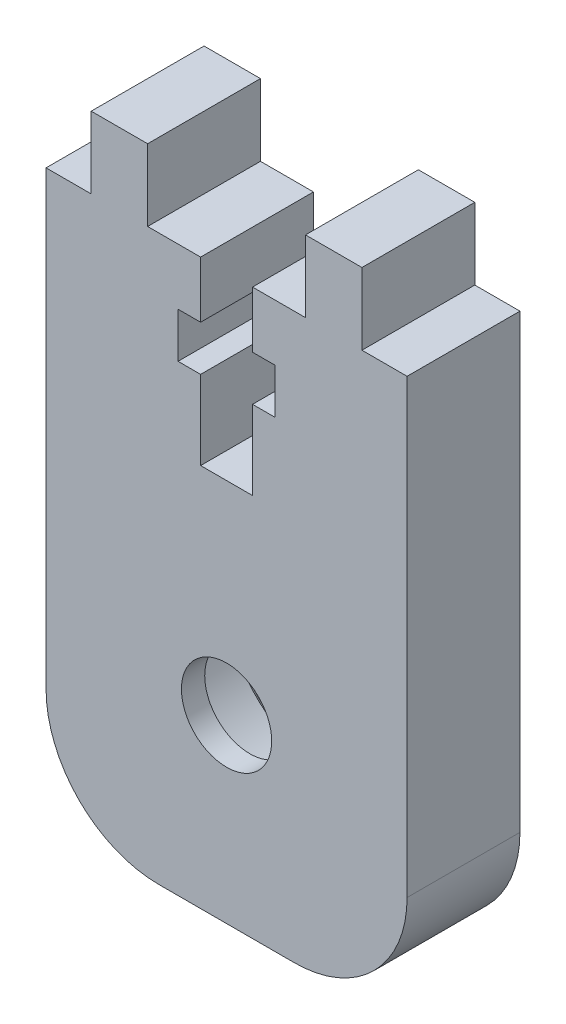
ISO-10303-21;
HEADER;
FILE_DESCRIPTION(('STEP AP214'),'2;1');
FILE_NAME('part.step','',(''),(''),'','','');
FILE_SCHEMA(('AUTOMOTIVE_DESIGN { 1 0 10303 214 1 1 1 1 }'));
ENDSEC;
DATA;
#1=APPLICATION_CONTEXT('core data for automotive mechanical design processes');
#2=APPLICATION_PROTOCOL_DEFINITION('international standard','automotive_design',2000,#1);
#3=PRODUCT_CONTEXT('',#1,'mechanical');
#4=PRODUCT('Part','Part','',(#3));
#5=PRODUCT_RELATED_PRODUCT_CATEGORY('part','',(#4));
#6=PRODUCT_DEFINITION_FORMATION('','',#4);
#7=PRODUCT_DEFINITION_CONTEXT('part definition',#1,'design');
#8=PRODUCT_DEFINITION('design','',#6,#7);
#9=PRODUCT_DEFINITION_SHAPE('','',#8);
#10=(LENGTH_UNIT() NAMED_UNIT(*) SI_UNIT(.MILLI.,.METRE.));
#11=(NAMED_UNIT(*) PLANE_ANGLE_UNIT() SI_UNIT($,.RADIAN.));
#12=(NAMED_UNIT(*) SI_UNIT($,.STERADIAN.) SOLID_ANGLE_UNIT());
#13=UNCERTAINTY_MEASURE_WITH_UNIT(LENGTH_MEASURE(1.E-05),#10,'distance_accuracy_value','');
#14=(GEOMETRIC_REPRESENTATION_CONTEXT(3) GLOBAL_UNCERTAINTY_ASSIGNED_CONTEXT((#13)) GLOBAL_UNIT_ASSIGNED_CONTEXT((#10,
#11,#12)) REPRESENTATION_CONTEXT('',''));
#15=CARTESIAN_POINT('',(0.,0.,0.));
#16=DIRECTION('',(0.,0.,1.));
#17=DIRECTION('',(1.,0.,0.));
#18=AXIS2_PLACEMENT_3D('',#15,#16,#17);
#19=CARTESIAN_POINT('',(0.,-4.5,3.96875));
#20=DIRECTION('',(0.,0.,-1.));
#21=DIRECTION('',(-1.,0.,0.));
#22=AXIS2_PLACEMENT_3D('',#19,#20,#21);
#23=PLANE('',#22);
#24=CARTESIAN_POINT('',(0.,-4.5,3.96875));
#25=DIRECTION('',(0.,0.,-1.));
#26=DIRECTION('',(-1.,0.,0.));
#27=AXIS2_PLACEMENT_3D('',#24,#25,#26);
#28=CIRCLE('',#27,2.);
#29=CARTESIAN_POINT('',(-2.00000000000001,-4.5,3.96875));
#30=VERTEX_POINT('',#29);
#31=EDGE_CURVE('E689',#30,#30,#28,.T.);
#32=ORIENTED_EDGE('',*,*,#31,.F.);
#33=EDGE_LOOP('',(#32));
#34=FACE_BOUND('',#33,.T.);
#35=CARTESIAN_POINT('',(0.,-4.5,3.96875));
#36=DIRECTION('',(0.,0.,1.));
#37=DIRECTION('',(1.,0.,0.));
#38=AXIS2_PLACEMENT_3D('',#35,#36,#37);
#39=CIRCLE('',#38,4.68819660112501);
#40=CARTESIAN_POINT('',(4.688196601125,-4.5,3.96875));
#41=VERTEX_POINT('',#40);
#42=EDGE_CURVE('E42',#41,#41,#39,.T.);
#43=ORIENTED_EDGE('',*,*,#42,.F.);
#44=EDGE_LOOP('',(#43));
#45=FACE_BOUND('',#44,.T.);
#46=ADVANCED_FACE('F38',(#34,#45),#23,.T.);
#47=CARTESIAN_POINT('',(-5.998,12.5,5.));
#48=DIRECTION('',(0.,-1.,0.));
#49=DIRECTION('',(0.,0.,-1.));
#50=AXIS2_PLACEMENT_3D('',#47,#48,#49);
#51=PLANE('',#50);
#52=DIRECTION('',(-1.,0.,0.));
#53=VECTOR('',#52,1.);
#54=CARTESIAN_POINT('',(-5.998,12.5,0.));
#55=LINE('',#54,#53);
#56=CARTESIAN_POINT('',(-5.998,12.5,0.));
#57=VERTEX_POINT('',#56);
#58=CARTESIAN_POINT('',(-7.998,12.5,0.));
#59=VERTEX_POINT('',#58);
#60=EDGE_CURVE('E236',#57,#59,#55,.T.);
#61=ORIENTED_EDGE('',*,*,#60,.T.);
#62=DIRECTION('',(0.,0.,-1.));
#63=VECTOR('',#62,1.);
#64=CARTESIAN_POINT('',(-7.998,12.5,5.));
#65=LINE('',#64,#63);
#66=CARTESIAN_POINT('',(-7.998,12.5,5.));
#67=VERTEX_POINT('',#66);
#68=EDGE_CURVE('E217',#67,#59,#65,.T.);
#69=ORIENTED_EDGE('',*,*,#68,.F.);
#70=DIRECTION('',(-1.,0.,0.));
#71=VECTOR('',#70,1.);
#72=CARTESIAN_POINT('',(-5.998,12.5,5.));
#73=LINE('',#72,#71);
#74=CARTESIAN_POINT('',(-5.998,12.5,5.));
#75=VERTEX_POINT('',#74);
#76=EDGE_CURVE('E222',#75,#67,#73,.T.);
#77=ORIENTED_EDGE('',*,*,#76,.F.);
#78=DIRECTION('',(0.,0.,-1.));
#79=VECTOR('',#78,1.);
#80=CARTESIAN_POINT('',(-5.998,12.5,5.));
#81=LINE('',#80,#79);
#82=EDGE_CURVE('E477',#75,#57,#81,.T.);
#83=ORIENTED_EDGE('',*,*,#82,.T.);
#84=EDGE_LOOP('',(#61,#69,#77,#83));
#85=FACE_BOUND('',#84,.T.);
#86=ADVANCED_FACE('F234',(#85),#51,.F.);
#87=CARTESIAN_POINT('',(-7.998,-12.5,5.));
#88=DIRECTION('',(1.,0.,0.));
#89=DIRECTION('',(0.,0.,-1.));
#90=AXIS2_PLACEMENT_3D('',#87,#88,#89);
#91=PLANE('',#90);
#92=DIRECTION('',(0.,-1.,0.));
#93=VECTOR('',#92,1.);
#94=CARTESIAN_POINT('',(-7.998,-12.5,0.));
#95=LINE('',#94,#93);
#96=CARTESIAN_POINT('',(-7.998,-7.5,0.));
#97=VERTEX_POINT('',#96);
#98=EDGE_CURVE('E480',#59,#97,#95,.T.);
#99=ORIENTED_EDGE('',*,*,#98,.T.);
#100=DIRECTION('',(0.,0.,-1.));
#101=VECTOR('',#100,1.);
#102=CARTESIAN_POINT('',(-7.998,-7.5,5.));
#103=LINE('',#102,#101);
#104=CARTESIAN_POINT('',(-7.998,-7.5,5.));
#105=VERTEX_POINT('',#104);
#106=EDGE_CURVE('E63',#97,#105,#103,.F.);
#107=ORIENTED_EDGE('',*,*,#106,.T.);
#108=DIRECTION('',(0.,-1.,0.));
#109=VECTOR('',#108,1.);
#110=CARTESIAN_POINT('',(-7.998,-12.5,5.));
#111=LINE('',#110,#109);
#112=EDGE_CURVE('E213',#67,#105,#111,.T.);
#113=ORIENTED_EDGE('',*,*,#112,.F.);
#114=ORIENTED_EDGE('',*,*,#68,.T.);
#115=EDGE_LOOP('',(#99,#107,#113,#114));
#116=FACE_BOUND('',#115,.T.);
#117=ADVANCED_FACE('F215',(#116),#91,.F.);
#118=CARTESIAN_POINT('',(7.998,-12.5,5.));
#119=DIRECTION('',(0.,1.,0.));
#120=DIRECTION('',(-1.,0.,0.));
#121=AXIS2_PLACEMENT_3D('',#118,#119,#120);
#122=PLANE('',#121);
#123=DIRECTION('',(1.,0.,0.));
#124=VECTOR('',#123,1.);
#125=CARTESIAN_POINT('',(7.998,-12.5,5.));
#126=LINE('',#125,#124);
#127=CARTESIAN_POINT('',(-2.998,-12.5,5.));
#128=VERTEX_POINT('',#127);
#129=CARTESIAN_POINT('',(2.998,-12.5,5.));
#130=VERTEX_POINT('',#129);
#131=EDGE_CURVE('E221',#128,#130,#126,.T.);
#132=ORIENTED_EDGE('',*,*,#131,.F.);
#133=DIRECTION('',(0.,0.,-1.));
#134=VECTOR('',#133,1.);
#135=CARTESIAN_POINT('',(-2.998,-12.5,5.));
#136=LINE('',#135,#134);
#137=CARTESIAN_POINT('',(-2.998,-12.5,0.));
#138=VERTEX_POINT('',#137);
#139=EDGE_CURVE('E243',#128,#138,#136,.T.);
#140=ORIENTED_EDGE('',*,*,#139,.T.);
#141=DIRECTION('',(1.,0.,0.));
#142=VECTOR('',#141,1.);
#143=CARTESIAN_POINT('',(7.998,-12.5,0.));
#144=LINE('',#143,#142);
#145=CARTESIAN_POINT('',(2.998,-12.5,0.));
#146=VERTEX_POINT('',#145);
#147=EDGE_CURVE('E484',#138,#146,#144,.T.);
#148=ORIENTED_EDGE('',*,*,#147,.T.);
#149=DIRECTION('',(0.,0.,-1.));
#150=VECTOR('',#149,1.);
#151=CARTESIAN_POINT('',(2.998,-12.5,5.));
#152=LINE('',#151,#150);
#153=EDGE_CURVE('E238',#146,#130,#152,.F.);
#154=ORIENTED_EDGE('',*,*,#153,.T.);
#155=EDGE_LOOP('',(#132,#140,#148,#154));
#156=FACE_BOUND('',#155,.T.);
#157=ADVANCED_FACE('F394',(#156),#122,.F.);
#158=CARTESIAN_POINT('',(7.998,-12.5,5.));
#159=DIRECTION('',(-1.,0.,0.));
#160=DIRECTION('',(0.,0.,1.));
#161=AXIS2_PLACEMENT_3D('',#158,#159,#160);
#162=PLANE('',#161);
#163=DIRECTION('',(0.,1.,0.));
#164=VECTOR('',#163,1.);
#165=CARTESIAN_POINT('',(7.998,-12.5,5.));
#166=LINE('',#165,#164);
#167=CARTESIAN_POINT('',(7.998,-7.5,5.));
#168=VERTEX_POINT('',#167);
#169=CARTESIAN_POINT('',(7.998,12.5,5.));
#170=VERTEX_POINT('',#169);
#171=EDGE_CURVE('E413',#168,#170,#166,.T.);
#172=ORIENTED_EDGE('',*,*,#171,.F.);
#173=DIRECTION('',(0.,0.,-1.));
#174=VECTOR('',#173,1.);
#175=CARTESIAN_POINT('',(7.998,-7.5,5.));
#176=LINE('',#175,#174);
#177=CARTESIAN_POINT('',(7.998,-7.5,0.));
#178=VERTEX_POINT('',#177);
#179=EDGE_CURVE('E266',#168,#178,#176,.T.);
#180=ORIENTED_EDGE('',*,*,#179,.T.);
#181=DIRECTION('',(0.,1.,0.));
#182=VECTOR('',#181,1.);
#183=CARTESIAN_POINT('',(7.998,-12.5,0.));
#184=LINE('',#183,#182);
#185=CARTESIAN_POINT('',(7.998,12.5,0.));
#186=VERTEX_POINT('',#185);
#187=EDGE_CURVE('E487',#178,#186,#184,.T.);
#188=ORIENTED_EDGE('',*,*,#187,.T.);
#189=DIRECTION('',(0.,0.,-1.));
#190=VECTOR('',#189,1.);
#191=CARTESIAN_POINT('',(7.998,12.5,5.));
#192=LINE('',#191,#190);
#193=EDGE_CURVE('E239',#170,#186,#192,.T.);
#194=ORIENTED_EDGE('',*,*,#193,.F.);
#195=EDGE_LOOP('',(#172,#180,#188,#194));
#196=FACE_BOUND('',#195,.T.);
#197=ADVANCED_FACE('F390',(#196),#162,.F.);
#198=CARTESIAN_POINT('',(7.998,12.5,5.));
#199=DIRECTION('',(0.,-1.,0.));
#200=DIRECTION('',(0.,0.,-1.));
#201=AXIS2_PLACEMENT_3D('',#198,#199,#200);
#202=PLANE('',#201);
#203=DIRECTION('',(-1.,0.,0.));
#204=VECTOR('',#203,1.);
#205=CARTESIAN_POINT('',(7.998,12.5,0.));
#206=LINE('',#205,#204);
#207=CARTESIAN_POINT('',(5.998,12.5,0.));
#208=VERTEX_POINT('',#207);
#209=EDGE_CURVE('E490',#186,#208,#206,.T.);
#210=ORIENTED_EDGE('',*,*,#209,.T.);
#211=DIRECTION('',(0.,0.,-1.));
#212=VECTOR('',#211,1.);
#213=CARTESIAN_POINT('',(5.998,12.5,5.));
#214=LINE('',#213,#212);
#215=CARTESIAN_POINT('',(5.998,12.5,5.));
#216=VERTEX_POINT('',#215);
#217=EDGE_CURVE('E246',#216,#208,#214,.T.);
#218=ORIENTED_EDGE('',*,*,#217,.F.);
#219=DIRECTION('',(-1.,0.,0.));
#220=VECTOR('',#219,1.);
#221=CARTESIAN_POINT('',(7.998,12.5,5.));
#222=LINE('',#221,#220);
#223=EDGE_CURVE('E416',#170,#216,#222,.T.);
#224=ORIENTED_EDGE('',*,*,#223,.F.);
#225=ORIENTED_EDGE('',*,*,#193,.T.);
#226=EDGE_LOOP('',(#210,#218,#224,#225));
#227=FACE_BOUND('',#226,.T.);
#228=ADVANCED_FACE('F386',(#227),#202,.F.);
#229=CARTESIAN_POINT('',(5.998,12.5,5.));
#230=DIRECTION('',(-1.,0.,0.));
#231=DIRECTION('',(0.,0.,1.));
#232=AXIS2_PLACEMENT_3D('',#229,#230,#231);
#233=PLANE('',#232);
#234=DIRECTION('',(0.,1.,0.));
#235=VECTOR('',#234,1.);
#236=CARTESIAN_POINT('',(5.998,12.5,0.));
#237=LINE('',#236,#235);
#238=CARTESIAN_POINT('',(5.998,15.675,0.));
#239=VERTEX_POINT('',#238);
#240=EDGE_CURVE('E493',#208,#239,#237,.T.);
#241=ORIENTED_EDGE('',*,*,#240,.T.);
#242=DIRECTION('',(0.,0.,-1.));
#243=VECTOR('',#242,1.);
#244=CARTESIAN_POINT('',(5.998,15.675,5.));
#245=LINE('',#244,#243);
#246=CARTESIAN_POINT('',(5.998,15.675,5.));
#247=VERTEX_POINT('',#246);
#248=EDGE_CURVE('E619',#247,#239,#245,.T.);
#249=ORIENTED_EDGE('',*,*,#248,.F.);
#250=DIRECTION('',(0.,1.,0.));
#251=VECTOR('',#250,1.);
#252=CARTESIAN_POINT('',(5.998,12.5,5.));
#253=LINE('',#252,#251);
#254=EDGE_CURVE('E421',#216,#247,#253,.T.);
#255=ORIENTED_EDGE('',*,*,#254,.F.);
#256=ORIENTED_EDGE('',*,*,#217,.T.);
#257=EDGE_LOOP('',(#241,#249,#255,#256));
#258=FACE_BOUND('',#257,.T.);
#259=ADVANCED_FACE('F382',(#258),#233,.F.);
#260=CARTESIAN_POINT('',(5.998,15.675,5.));
#261=DIRECTION('',(0.,-1.,0.));
#262=DIRECTION('',(0.,0.,-1.));
#263=AXIS2_PLACEMENT_3D('',#260,#261,#262);
#264=PLANE('',#263);
#265=DIRECTION('',(-1.,0.,0.));
#266=VECTOR('',#265,1.);
#267=CARTESIAN_POINT('',(5.998,15.675,0.));
#268=LINE('',#267,#266);
#269=CARTESIAN_POINT('',(3.498,15.675,0.));
#270=VERTEX_POINT('',#269);
#271=EDGE_CURVE('E496',#239,#270,#268,.T.);
#272=ORIENTED_EDGE('',*,*,#271,.T.);
#273=DIRECTION('',(0.,0.,-1.));
#274=VECTOR('',#273,1.);
#275=CARTESIAN_POINT('',(3.498,15.675,5.));
#276=LINE('',#275,#274);
#277=CARTESIAN_POINT('',(3.498,15.675,5.));
#278=VERTEX_POINT('',#277);
#279=EDGE_CURVE('E615',#278,#270,#276,.T.);
#280=ORIENTED_EDGE('',*,*,#279,.F.);
#281=DIRECTION('',(-1.,0.,0.));
#282=VECTOR('',#281,1.);
#283=CARTESIAN_POINT('',(5.998,15.675,5.));
#284=LINE('',#283,#282);
#285=EDGE_CURVE('E424',#247,#278,#284,.T.);
#286=ORIENTED_EDGE('',*,*,#285,.F.);
#287=ORIENTED_EDGE('',*,*,#248,.T.);
#288=EDGE_LOOP('',(#272,#280,#286,#287));
#289=FACE_BOUND('',#288,.T.);
#290=ADVANCED_FACE('F378',(#289),#264,.F.);
#291=CARTESIAN_POINT('',(3.498,12.5,5.));
#292=DIRECTION('',(1.,0.,0.));
#293=DIRECTION('',(0.,0.,-1.));
#294=AXIS2_PLACEMENT_3D('',#291,#292,#293);
#295=PLANE('',#294);
#296=DIRECTION('',(0.,-1.,0.));
#297=VECTOR('',#296,1.);
#298=CARTESIAN_POINT('',(3.498,12.5,0.));
#299=LINE('',#298,#297);
#300=CARTESIAN_POINT('',(3.498,12.5,0.));
#301=VERTEX_POINT('',#300);
#302=EDGE_CURVE('E499',#270,#301,#299,.T.);
#303=ORIENTED_EDGE('',*,*,#302,.T.);
#304=DIRECTION('',(0.,0.,-1.));
#305=VECTOR('',#304,1.);
#306=CARTESIAN_POINT('',(3.498,12.5,5.));
#307=LINE('',#306,#305);
#308=CARTESIAN_POINT('',(3.498,12.5,5.));
#309=VERTEX_POINT('',#308);
#310=EDGE_CURVE('E611',#309,#301,#307,.T.);
#311=ORIENTED_EDGE('',*,*,#310,.F.);
#312=DIRECTION('',(0.,-1.,0.));
#313=VECTOR('',#312,1.);
#314=CARTESIAN_POINT('',(3.498,12.5,5.));
#315=LINE('',#314,#313);
#316=EDGE_CURVE('E427',#278,#309,#315,.T.);
#317=ORIENTED_EDGE('',*,*,#316,.F.);
#318=ORIENTED_EDGE('',*,*,#279,.T.);
#319=EDGE_LOOP('',(#303,#311,#317,#318));
#320=FACE_BOUND('',#319,.T.);
#321=ADVANCED_FACE('F374',(#320),#295,.F.);
#322=CARTESIAN_POINT('',(1.15,12.5,5.));
#323=DIRECTION('',(0.,-1.,0.));
#324=DIRECTION('',(1.,0.,0.));
#325=AXIS2_PLACEMENT_3D('',#322,#323,#324);
#326=PLANE('',#325);
#327=DIRECTION('',(-1.,0.,0.));
#328=VECTOR('',#327,1.);
#329=CARTESIAN_POINT('',(1.15,12.5,0.));
#330=LINE('',#329,#328);
#331=CARTESIAN_POINT('',(1.15,12.5,0.));
#332=VERTEX_POINT('',#331);
#333=EDGE_CURVE('E502',#301,#332,#330,.T.);
#334=ORIENTED_EDGE('',*,*,#333,.T.);
#335=DIRECTION('',(0.,0.,-1.));
#336=VECTOR('',#335,1.);
#337=CARTESIAN_POINT('',(1.15,12.5,5.));
#338=LINE('',#337,#336);
#339=CARTESIAN_POINT('',(1.15,12.5,5.));
#340=VERTEX_POINT('',#339);
#341=EDGE_CURVE('E607',#340,#332,#338,.T.);
#342=ORIENTED_EDGE('',*,*,#341,.F.);
#343=DIRECTION('',(-1.,0.,0.));
#344=VECTOR('',#343,1.);
#345=CARTESIAN_POINT('',(1.15,12.5,5.));
#346=LINE('',#345,#344);
#347=EDGE_CURVE('E430',#309,#340,#346,.T.);
#348=ORIENTED_EDGE('',*,*,#347,.F.);
#349=ORIENTED_EDGE('',*,*,#310,.T.);
#350=EDGE_LOOP('',(#334,#342,#348,#349));
#351=FACE_BOUND('',#350,.T.);
#352=ADVANCED_FACE('F370',(#351),#326,.F.);
#353=CARTESIAN_POINT('',(1.15,12.5,5.));
#354=DIRECTION('',(1.,0.,0.));
#355=DIRECTION('',(0.,1.,0.));
#356=AXIS2_PLACEMENT_3D('',#353,#354,#355);
#357=PLANE('',#356);
#358=DIRECTION('',(0.,-1.,0.));
#359=VECTOR('',#358,1.);
#360=CARTESIAN_POINT('',(1.15,12.5,0.));
#361=LINE('',#360,#359);
#362=CARTESIAN_POINT('',(1.15,10.,0.));
#363=VERTEX_POINT('',#362);
#364=EDGE_CURVE('E505',#332,#363,#361,.T.);
#365=ORIENTED_EDGE('',*,*,#364,.T.);
#366=DIRECTION('',(0.,0.,-1.));
#367=VECTOR('',#366,1.);
#368=CARTESIAN_POINT('',(1.15,10.,5.));
#369=LINE('',#368,#367);
#370=CARTESIAN_POINT('',(1.15,10.,5.));
#371=VERTEX_POINT('',#370);
#372=EDGE_CURVE('E603',#371,#363,#369,.T.);
#373=ORIENTED_EDGE('',*,*,#372,.F.);
#374=DIRECTION('',(0.,-1.,0.));
#375=VECTOR('',#374,1.);
#376=CARTESIAN_POINT('',(1.15,12.5,5.));
#377=LINE('',#376,#375);
#378=EDGE_CURVE('E433',#340,#371,#377,.T.);
#379=ORIENTED_EDGE('',*,*,#378,.F.);
#380=ORIENTED_EDGE('',*,*,#341,.T.);
#381=EDGE_LOOP('',(#365,#373,#379,#380));
#382=FACE_BOUND('',#381,.T.);
#383=ADVANCED_FACE('F366',(#382),#357,.F.);
#384=CARTESIAN_POINT('',(2.15,10.,5.));
#385=DIRECTION('',(0.,1.,0.));
#386=DIRECTION('',(0.,0.,1.));
#387=AXIS2_PLACEMENT_3D('',#384,#385,#386);
#388=PLANE('',#387);
#389=DIRECTION('',(1.,0.,0.));
#390=VECTOR('',#389,1.);
#391=CARTESIAN_POINT('',(2.15,10.,0.));
#392=LINE('',#391,#390);
#393=CARTESIAN_POINT('',(2.15,10.,0.));
#394=VERTEX_POINT('',#393);
#395=EDGE_CURVE('E508',#363,#394,#392,.T.);
#396=ORIENTED_EDGE('',*,*,#395,.T.);
#397=DIRECTION('',(0.,0.,-1.));
#398=VECTOR('',#397,1.);
#399=CARTESIAN_POINT('',(2.15,10.,5.));
#400=LINE('',#399,#398);
#401=CARTESIAN_POINT('',(2.15,10.,5.));
#402=VERTEX_POINT('',#401);
#403=EDGE_CURVE('E599',#402,#394,#400,.T.);
#404=ORIENTED_EDGE('',*,*,#403,.F.);
#405=DIRECTION('',(1.,0.,0.));
#406=VECTOR('',#405,1.);
#407=CARTESIAN_POINT('',(2.15,10.,5.));
#408=LINE('',#407,#406);
#409=EDGE_CURVE('E436',#371,#402,#408,.T.);
#410=ORIENTED_EDGE('',*,*,#409,.F.);
#411=ORIENTED_EDGE('',*,*,#372,.T.);
#412=EDGE_LOOP('',(#396,#404,#410,#411));
#413=FACE_BOUND('',#412,.T.);
#414=ADVANCED_FACE('F362',(#413),#388,.F.);
#415=CARTESIAN_POINT('',(2.15,10.,5.));
#416=DIRECTION('',(1.,0.,0.));
#417=DIRECTION('',(0.,1.,0.));
#418=AXIS2_PLACEMENT_3D('',#415,#416,#417);
#419=PLANE('',#418);
#420=DIRECTION('',(0.,-1.,0.));
#421=VECTOR('',#420,1.);
#422=CARTESIAN_POINT('',(2.15,10.,0.));
#423=LINE('',#422,#421);
#424=CARTESIAN_POINT('',(2.15,8.,0.));
#425=VERTEX_POINT('',#424);
#426=EDGE_CURVE('E511',#394,#425,#423,.T.);
#427=ORIENTED_EDGE('',*,*,#426,.T.);
#428=DIRECTION('',(0.,0.,-1.));
#429=VECTOR('',#428,1.);
#430=CARTESIAN_POINT('',(2.15,8.,5.));
#431=LINE('',#430,#429);
#432=CARTESIAN_POINT('',(2.15,8.,5.));
#433=VERTEX_POINT('',#432);
#434=EDGE_CURVE('E595',#433,#425,#431,.T.);
#435=ORIENTED_EDGE('',*,*,#434,.F.);
#436=DIRECTION('',(0.,-1.,0.));
#437=VECTOR('',#436,1.);
#438=CARTESIAN_POINT('',(2.15,10.,5.));
#439=LINE('',#438,#437);
#440=EDGE_CURVE('E439',#402,#433,#439,.T.);
#441=ORIENTED_EDGE('',*,*,#440,.F.);
#442=ORIENTED_EDGE('',*,*,#403,.T.);
#443=EDGE_LOOP('',(#427,#435,#441,#442));
#444=FACE_BOUND('',#443,.T.);
#445=ADVANCED_FACE('F358',(#444),#419,.F.);
#446=CARTESIAN_POINT('',(2.15,8.,5.));
#447=DIRECTION('',(0.,-1.,0.));
#448=DIRECTION('',(0.,0.,-1.));
#449=AXIS2_PLACEMENT_3D('',#446,#447,#448);
#450=PLANE('',#449);
#451=DIRECTION('',(-1.,0.,0.));
#452=VECTOR('',#451,1.);
#453=CARTESIAN_POINT('',(2.15,8.,0.));
#454=LINE('',#453,#452);
#455=CARTESIAN_POINT('',(1.15,8.,0.));
#456=VERTEX_POINT('',#455);
#457=EDGE_CURVE('E514',#425,#456,#454,.T.);
#458=ORIENTED_EDGE('',*,*,#457,.T.);
#459=DIRECTION('',(0.,0.,-1.));
#460=VECTOR('',#459,1.);
#461=CARTESIAN_POINT('',(1.15,8.,5.));
#462=LINE('',#461,#460);
#463=CARTESIAN_POINT('',(1.15,8.,5.));
#464=VERTEX_POINT('',#463);
#465=EDGE_CURVE('E591',#464,#456,#462,.T.);
#466=ORIENTED_EDGE('',*,*,#465,.F.);
#467=DIRECTION('',(-1.,0.,0.));
#468=VECTOR('',#467,1.);
#469=CARTESIAN_POINT('',(2.15,8.,5.));
#470=LINE('',#469,#468);
#471=EDGE_CURVE('E442',#433,#464,#470,.T.);
#472=ORIENTED_EDGE('',*,*,#471,.F.);
#473=ORIENTED_EDGE('',*,*,#434,.T.);
#474=EDGE_LOOP('',(#458,#466,#472,#473));
#475=FACE_BOUND('',#474,.T.);
#476=ADVANCED_FACE('F354',(#475),#450,.F.);
#477=CARTESIAN_POINT('',(1.15,8.,5.));
#478=DIRECTION('',(1.,0.,0.));
#479=DIRECTION('',(0.,0.,-1.));
#480=AXIS2_PLACEMENT_3D('',#477,#478,#479);
#481=PLANE('',#480);
#482=DIRECTION('',(0.,-1.,0.));
#483=VECTOR('',#482,1.);
#484=CARTESIAN_POINT('',(1.15,8.,0.));
#485=LINE('',#484,#483);
#486=CARTESIAN_POINT('',(1.15,4.5,0.));
#487=VERTEX_POINT('',#486);
#488=EDGE_CURVE('E517',#456,#487,#485,.T.);
#489=ORIENTED_EDGE('',*,*,#488,.T.);
#490=DIRECTION('',(0.,0.,-1.));
#491=VECTOR('',#490,1.);
#492=CARTESIAN_POINT('',(1.15,4.5,5.));
#493=LINE('',#492,#491);
#494=CARTESIAN_POINT('',(1.15,4.5,5.));
#495=VERTEX_POINT('',#494);
#496=EDGE_CURVE('E587',#495,#487,#493,.T.);
#497=ORIENTED_EDGE('',*,*,#496,.F.);
#498=DIRECTION('',(0.,-1.,0.));
#499=VECTOR('',#498,1.);
#500=CARTESIAN_POINT('',(1.15,8.,5.));
#501=LINE('',#500,#499);
#502=EDGE_CURVE('E445',#464,#495,#501,.T.);
#503=ORIENTED_EDGE('',*,*,#502,.F.);
#504=ORIENTED_EDGE('',*,*,#465,.T.);
#505=EDGE_LOOP('',(#489,#497,#503,#504));
#506=FACE_BOUND('',#505,.T.);
#507=ADVANCED_FACE('F350',(#506),#481,.F.);
#508=CARTESIAN_POINT('',(1.15,4.5,5.));
#509=DIRECTION('',(0.,-1.,0.));
#510=DIRECTION('',(0.,0.,-1.));
#511=AXIS2_PLACEMENT_3D('',#508,#509,#510);
#512=PLANE('',#511);
#513=DIRECTION('',(-1.,0.,0.));
#514=VECTOR('',#513,1.);
#515=CARTESIAN_POINT('',(1.15,4.5,0.));
#516=LINE('',#515,#514);
#517=CARTESIAN_POINT('',(-1.15,4.5,0.));
#518=VERTEX_POINT('',#517);
#519=EDGE_CURVE('E520',#487,#518,#516,.T.);
#520=ORIENTED_EDGE('',*,*,#519,.T.);
#521=DIRECTION('',(0.,0.,-1.));
#522=VECTOR('',#521,1.);
#523=CARTESIAN_POINT('',(-1.15,4.5,5.));
#524=LINE('',#523,#522);
#525=CARTESIAN_POINT('',(-1.15,4.5,5.));
#526=VERTEX_POINT('',#525);
#527=EDGE_CURVE('E583',#526,#518,#524,.T.);
#528=ORIENTED_EDGE('',*,*,#527,.F.);
#529=DIRECTION('',(-1.,0.,0.));
#530=VECTOR('',#529,1.);
#531=CARTESIAN_POINT('',(1.15,4.5,5.));
#532=LINE('',#531,#530);
#533=EDGE_CURVE('E448',#495,#526,#532,.T.);
#534=ORIENTED_EDGE('',*,*,#533,.F.);
#535=ORIENTED_EDGE('',*,*,#496,.T.);
#536=EDGE_LOOP('',(#520,#528,#534,#535));
#537=FACE_BOUND('',#536,.T.);
#538=ADVANCED_FACE('F346',(#537),#512,.F.);
#539=CARTESIAN_POINT('',(-1.15,8.,5.));
#540=DIRECTION('',(-1.,0.,0.));
#541=DIRECTION('',(0.,0.,1.));
#542=AXIS2_PLACEMENT_3D('',#539,#540,#541);
#543=PLANE('',#542);
#544=DIRECTION('',(0.,1.,0.));
#545=VECTOR('',#544,1.);
#546=CARTESIAN_POINT('',(-1.15,8.,0.));
#547=LINE('',#546,#545);
#548=CARTESIAN_POINT('',(-1.15,8.,0.));
#549=VERTEX_POINT('',#548);
#550=EDGE_CURVE('E523',#518,#549,#547,.T.);
#551=ORIENTED_EDGE('',*,*,#550,.T.);
#552=DIRECTION('',(0.,0.,-1.));
#553=VECTOR('',#552,1.);
#554=CARTESIAN_POINT('',(-1.15,8.,5.));
#555=LINE('',#554,#553);
#556=CARTESIAN_POINT('',(-1.15,8.,5.));
#557=VERTEX_POINT('',#556);
#558=EDGE_CURVE('E579',#557,#549,#555,.T.);
#559=ORIENTED_EDGE('',*,*,#558,.F.);
#560=DIRECTION('',(0.,1.,0.));
#561=VECTOR('',#560,1.);
#562=CARTESIAN_POINT('',(-1.15,8.,5.));
#563=LINE('',#562,#561);
#564=EDGE_CURVE('E451',#526,#557,#563,.T.);
#565=ORIENTED_EDGE('',*,*,#564,.F.);
#566=ORIENTED_EDGE('',*,*,#527,.T.);
#567=EDGE_LOOP('',(#551,#559,#565,#566));
#568=FACE_BOUND('',#567,.T.);
#569=ADVANCED_FACE('F342',(#568),#543,.F.);
#570=CARTESIAN_POINT('',(-1.15,8.,5.));
#571=DIRECTION('',(0.,-1.,0.));
#572=DIRECTION('',(0.,0.,-1.));
#573=AXIS2_PLACEMENT_3D('',#570,#571,#572);
#574=PLANE('',#573);
#575=DIRECTION('',(-1.,0.,0.));
#576=VECTOR('',#575,1.);
#577=CARTESIAN_POINT('',(-1.15,8.,0.));
#578=LINE('',#577,#576);
#579=CARTESIAN_POINT('',(-2.15,8.,0.));
#580=VERTEX_POINT('',#579);
#581=EDGE_CURVE('E526',#549,#580,#578,.T.);
#582=ORIENTED_EDGE('',*,*,#581,.T.);
#583=DIRECTION('',(0.,0.,-1.));
#584=VECTOR('',#583,1.);
#585=CARTESIAN_POINT('',(-2.15,8.,5.));
#586=LINE('',#585,#584);
#587=CARTESIAN_POINT('',(-2.15,8.,5.));
#588=VERTEX_POINT('',#587);
#589=EDGE_CURVE('E575',#588,#580,#586,.T.);
#590=ORIENTED_EDGE('',*,*,#589,.F.);
#591=DIRECTION('',(-1.,0.,0.));
#592=VECTOR('',#591,1.);
#593=CARTESIAN_POINT('',(-1.15,8.,5.));
#594=LINE('',#593,#592);
#595=EDGE_CURVE('E454',#557,#588,#594,.T.);
#596=ORIENTED_EDGE('',*,*,#595,.F.);
#597=ORIENTED_EDGE('',*,*,#558,.T.);
#598=EDGE_LOOP('',(#582,#590,#596,#597));
#599=FACE_BOUND('',#598,.T.);
#600=ADVANCED_FACE('F338',(#599),#574,.F.);
#601=CARTESIAN_POINT('',(-2.15,10.,5.));
#602=DIRECTION('',(-1.,0.,0.));
#603=DIRECTION('',(0.,-1.,0.));
#604=AXIS2_PLACEMENT_3D('',#601,#602,#603);
#605=PLANE('',#604);
#606=DIRECTION('',(0.,1.,0.));
#607=VECTOR('',#606,1.);
#608=CARTESIAN_POINT('',(-2.15,10.,0.));
#609=LINE('',#608,#607);
#610=CARTESIAN_POINT('',(-2.15,10.,0.));
#611=VERTEX_POINT('',#610);
#612=EDGE_CURVE('E529',#580,#611,#609,.T.);
#613=ORIENTED_EDGE('',*,*,#612,.T.);
#614=DIRECTION('',(0.,0.,-1.));
#615=VECTOR('',#614,1.);
#616=CARTESIAN_POINT('',(-2.15,10.,5.));
#617=LINE('',#616,#615);
#618=CARTESIAN_POINT('',(-2.15,10.,5.));
#619=VERTEX_POINT('',#618);
#620=EDGE_CURVE('E571',#619,#611,#617,.T.);
#621=ORIENTED_EDGE('',*,*,#620,.F.);
#622=DIRECTION('',(0.,1.,0.));
#623=VECTOR('',#622,1.);
#624=CARTESIAN_POINT('',(-2.15,10.,5.));
#625=LINE('',#624,#623);
#626=EDGE_CURVE('E457',#588,#619,#625,.T.);
#627=ORIENTED_EDGE('',*,*,#626,.F.);
#628=ORIENTED_EDGE('',*,*,#589,.T.);
#629=EDGE_LOOP('',(#613,#621,#627,#628));
#630=FACE_BOUND('',#629,.T.);
#631=ADVANCED_FACE('F334',(#630),#605,.F.);
#632=CARTESIAN_POINT('',(-1.15,10.,5.));
#633=DIRECTION('',(0.,1.,0.));
#634=DIRECTION('',(0.,0.,1.));
#635=AXIS2_PLACEMENT_3D('',#632,#633,#634);
#636=PLANE('',#635);
#637=DIRECTION('',(1.,0.,0.));
#638=VECTOR('',#637,1.);
#639=CARTESIAN_POINT('',(-1.15,10.,0.));
#640=LINE('',#639,#638);
#641=CARTESIAN_POINT('',(-1.15,10.,0.));
#642=VERTEX_POINT('',#641);
#643=EDGE_CURVE('E532',#611,#642,#640,.T.);
#644=ORIENTED_EDGE('',*,*,#643,.T.);
#645=DIRECTION('',(0.,0.,-1.));
#646=VECTOR('',#645,1.);
#647=CARTESIAN_POINT('',(-1.15,10.,5.));
#648=LINE('',#647,#646);
#649=CARTESIAN_POINT('',(-1.15,10.,5.));
#650=VERTEX_POINT('',#649);
#651=EDGE_CURVE('E567',#650,#642,#648,.T.);
#652=ORIENTED_EDGE('',*,*,#651,.F.);
#653=DIRECTION('',(1.,0.,0.));
#654=VECTOR('',#653,1.);
#655=CARTESIAN_POINT('',(-1.15,10.,5.));
#656=LINE('',#655,#654);
#657=EDGE_CURVE('E460',#619,#650,#656,.T.);
#658=ORIENTED_EDGE('',*,*,#657,.F.);
#659=ORIENTED_EDGE('',*,*,#620,.T.);
#660=EDGE_LOOP('',(#644,#652,#658,#659));
#661=FACE_BOUND('',#660,.T.);
#662=ADVANCED_FACE('F330',(#661),#636,.F.);
#663=CARTESIAN_POINT('',(-1.15,12.5,5.));
#664=DIRECTION('',(-1.,0.,0.));
#665=DIRECTION('',(0.,-1.,0.));
#666=AXIS2_PLACEMENT_3D('',#663,#664,#665);
#667=PLANE('',#666);
#668=DIRECTION('',(0.,1.,0.));
#669=VECTOR('',#668,1.);
#670=CARTESIAN_POINT('',(-1.15,12.5,0.));
#671=LINE('',#670,#669);
#672=CARTESIAN_POINT('',(-1.15,12.5,0.));
#673=VERTEX_POINT('',#672);
#674=EDGE_CURVE('E535',#642,#673,#671,.T.);
#675=ORIENTED_EDGE('',*,*,#674,.T.);
#676=DIRECTION('',(0.,0.,-1.));
#677=VECTOR('',#676,1.);
#678=CARTESIAN_POINT('',(-1.15,12.5,5.));
#679=LINE('',#678,#677);
#680=CARTESIAN_POINT('',(-1.15,12.5,5.));
#681=VERTEX_POINT('',#680);
#682=EDGE_CURVE('E563',#681,#673,#679,.T.);
#683=ORIENTED_EDGE('',*,*,#682,.F.);
#684=DIRECTION('',(0.,1.,0.));
#685=VECTOR('',#684,1.);
#686=CARTESIAN_POINT('',(-1.15,12.5,5.));
#687=LINE('',#686,#685);
#688=EDGE_CURVE('E463',#650,#681,#687,.T.);
#689=ORIENTED_EDGE('',*,*,#688,.F.);
#690=ORIENTED_EDGE('',*,*,#651,.T.);
#691=EDGE_LOOP('',(#675,#683,#689,#690));
#692=FACE_BOUND('',#691,.T.);
#693=ADVANCED_FACE('F326',(#692),#667,.F.);
#694=CARTESIAN_POINT('',(-1.15,12.5,5.));
#695=DIRECTION('',(0.,-1.,0.));
#696=DIRECTION('',(1.,0.,0.));
#697=AXIS2_PLACEMENT_3D('',#694,#695,#696);
#698=PLANE('',#697);
#699=DIRECTION('',(-1.,0.,0.));
#700=VECTOR('',#699,1.);
#701=CARTESIAN_POINT('',(-1.15,12.5,0.));
#702=LINE('',#701,#700);
#703=CARTESIAN_POINT('',(-3.498,12.5,0.));
#704=VERTEX_POINT('',#703);
#705=EDGE_CURVE('E538',#673,#704,#702,.T.);
#706=ORIENTED_EDGE('',*,*,#705,.T.);
#707=DIRECTION('',(0.,0.,-1.));
#708=VECTOR('',#707,1.);
#709=CARTESIAN_POINT('',(-3.498,12.5,5.));
#710=LINE('',#709,#708);
#711=CARTESIAN_POINT('',(-3.498,12.5,5.));
#712=VERTEX_POINT('',#711);
#713=EDGE_CURVE('E559',#712,#704,#710,.T.);
#714=ORIENTED_EDGE('',*,*,#713,.F.);
#715=DIRECTION('',(-1.,0.,0.));
#716=VECTOR('',#715,1.);
#717=CARTESIAN_POINT('',(-1.15,12.5,5.));
#718=LINE('',#717,#716);
#719=EDGE_CURVE('E466',#681,#712,#718,.T.);
#720=ORIENTED_EDGE('',*,*,#719,.F.);
#721=ORIENTED_EDGE('',*,*,#682,.T.);
#722=EDGE_LOOP('',(#706,#714,#720,#721));
#723=FACE_BOUND('',#722,.T.);
#724=ADVANCED_FACE('F322',(#723),#698,.F.);
#725=CARTESIAN_POINT('',(-3.498,12.5,5.));
#726=DIRECTION('',(-1.,0.,0.));
#727=DIRECTION('',(0.,-1.,0.));
#728=AXIS2_PLACEMENT_3D('',#725,#726,#727);
#729=PLANE('',#728);
#730=DIRECTION('',(0.,1.,0.));
#731=VECTOR('',#730,1.);
#732=CARTESIAN_POINT('',(-3.498,12.5,0.));
#733=LINE('',#732,#731);
#734=CARTESIAN_POINT('',(-3.498,15.675,0.));
#735=VERTEX_POINT('',#734);
#736=EDGE_CURVE('E541',#704,#735,#733,.T.);
#737=ORIENTED_EDGE('',*,*,#736,.T.);
#738=DIRECTION('',(0.,0.,-1.));
#739=VECTOR('',#738,1.);
#740=CARTESIAN_POINT('',(-3.498,15.675,5.));
#741=LINE('',#740,#739);
#742=CARTESIAN_POINT('',(-3.498,15.675,5.));
#743=VERTEX_POINT('',#742);
#744=EDGE_CURVE('E555',#743,#735,#741,.T.);
#745=ORIENTED_EDGE('',*,*,#744,.F.);
#746=DIRECTION('',(0.,1.,0.));
#747=VECTOR('',#746,1.);
#748=CARTESIAN_POINT('',(-3.498,12.5,5.));
#749=LINE('',#748,#747);
#750=EDGE_CURVE('E469',#712,#743,#749,.T.);
#751=ORIENTED_EDGE('',*,*,#750,.F.);
#752=ORIENTED_EDGE('',*,*,#713,.T.);
#753=EDGE_LOOP('',(#737,#745,#751,#752));
#754=FACE_BOUND('',#753,.T.);
#755=ADVANCED_FACE('F318',(#754),#729,.F.);
#756=CARTESIAN_POINT('',(-3.498,15.675,5.));
#757=DIRECTION('',(0.,-1.,0.));
#758=DIRECTION('',(0.,0.,-1.));
#759=AXIS2_PLACEMENT_3D('',#756,#757,#758);
#760=PLANE('',#759);
#761=DIRECTION('',(-1.,0.,0.));
#762=VECTOR('',#761,1.);
#763=CARTESIAN_POINT('',(-3.498,15.675,0.));
#764=LINE('',#763,#762);
#765=CARTESIAN_POINT('',(-5.998,15.675,0.));
#766=VERTEX_POINT('',#765);
#767=EDGE_CURVE('E544',#735,#766,#764,.T.);
#768=ORIENTED_EDGE('',*,*,#767,.T.);
#769=DIRECTION('',(0.,0.,-1.));
#770=VECTOR('',#769,1.);
#771=CARTESIAN_POINT('',(-5.998,15.675,5.));
#772=LINE('',#771,#770);
#773=CARTESIAN_POINT('',(-5.998,15.675,5.));
#774=VERTEX_POINT('',#773);
#775=EDGE_CURVE('E551',#774,#766,#772,.T.);
#776=ORIENTED_EDGE('',*,*,#775,.F.);
#777=DIRECTION('',(-1.,0.,0.));
#778=VECTOR('',#777,1.);
#779=CARTESIAN_POINT('',(-3.498,15.675,5.));
#780=LINE('',#779,#778);
#781=EDGE_CURVE('E472',#743,#774,#780,.T.);
#782=ORIENTED_EDGE('',*,*,#781,.F.);
#783=ORIENTED_EDGE('',*,*,#744,.T.);
#784=EDGE_LOOP('',(#768,#776,#782,#783));
#785=FACE_BOUND('',#784,.T.);
#786=ADVANCED_FACE('F314',(#785),#760,.F.);
#787=CARTESIAN_POINT('',(-5.998,12.5,5.));
#788=DIRECTION('',(1.,0.,0.));
#789=DIRECTION('',(0.,0.,-1.));
#790=AXIS2_PLACEMENT_3D('',#787,#788,#789);
#791=PLANE('',#790);
#792=DIRECTION('',(0.,-1.,0.));
#793=VECTOR('',#792,1.);
#794=CARTESIAN_POINT('',(-5.998,12.5,0.));
#795=LINE('',#794,#793);
#796=EDGE_CURVE('E232',#766,#57,#795,.T.);
#797=ORIENTED_EDGE('',*,*,#796,.T.);
#798=ORIENTED_EDGE('',*,*,#82,.F.);
#799=DIRECTION('',(0.,-1.,0.));
#800=VECTOR('',#799,1.);
#801=CARTESIAN_POINT('',(-5.998,12.5,5.));
#802=LINE('',#801,#800);
#803=EDGE_CURVE('E227',#774,#75,#802,.T.);
#804=ORIENTED_EDGE('',*,*,#803,.F.);
#805=ORIENTED_EDGE('',*,*,#775,.T.);
#806=EDGE_LOOP('',(#797,#798,#804,#805));
#807=FACE_BOUND('',#806,.T.);
#808=ADVANCED_FACE('F307',(#807),#791,.F.);
#809=CARTESIAN_POINT('',(0.,0.,5.));
#810=DIRECTION('',(0.,0.,-1.));
#811=DIRECTION('',(-1.,0.,0.));
#812=AXIS2_PLACEMENT_3D('',#809,#810,#811);
#813=PLANE('',#812);
#814=CARTESIAN_POINT('',(0.,-4.5,5.));
#815=DIRECTION('',(0.,0.,-1.));
#816=DIRECTION('',(-1.,0.,0.));
#817=AXIS2_PLACEMENT_3D('',#814,#815,#816);
#818=CIRCLE('',#817,2.);
#819=CARTESIAN_POINT('',(-2.00000000000001,-4.5,5.));
#820=VERTEX_POINT('',#819);
#821=EDGE_CURVE('E481',#820,#820,#818,.F.);
#822=ORIENTED_EDGE('',*,*,#821,.F.);
#823=EDGE_LOOP('',(#822));
#824=FACE_BOUND('',#823,.T.);
#825=ORIENTED_EDGE('',*,*,#112,.T.);
#826=CARTESIAN_POINT('',(-2.998,-7.5,5.));
#827=DIRECTION('',(0.,0.,-1.));
#828=DIRECTION('',(-1.,0.,0.));
#829=AXIS2_PLACEMENT_3D('',#826,#827,#828);
#830=CIRCLE('',#829,5.);
#831=EDGE_CURVE('E263',#105,#128,#830,.F.);
#832=ORIENTED_EDGE('',*,*,#831,.T.);
#833=ORIENTED_EDGE('',*,*,#131,.T.);
#834=CARTESIAN_POINT('',(2.998,-7.5,5.));
#835=DIRECTION('',(0.,0.,-1.));
#836=DIRECTION('',(-1.,0.,0.));
#837=AXIS2_PLACEMENT_3D('',#834,#835,#836);
#838=CIRCLE('',#837,5.);
#839=EDGE_CURVE('E55',#130,#168,#838,.F.);
#840=ORIENTED_EDGE('',*,*,#839,.T.);
#841=ORIENTED_EDGE('',*,*,#171,.T.);
#842=ORIENTED_EDGE('',*,*,#223,.T.);
#843=ORIENTED_EDGE('',*,*,#254,.T.);
#844=ORIENTED_EDGE('',*,*,#285,.T.);
#845=ORIENTED_EDGE('',*,*,#316,.T.);
#846=ORIENTED_EDGE('',*,*,#347,.T.);
#847=ORIENTED_EDGE('',*,*,#378,.T.);
#848=ORIENTED_EDGE('',*,*,#409,.T.);
#849=ORIENTED_EDGE('',*,*,#440,.T.);
#850=ORIENTED_EDGE('',*,*,#471,.T.);
#851=ORIENTED_EDGE('',*,*,#502,.T.);
#852=ORIENTED_EDGE('',*,*,#533,.T.);
#853=ORIENTED_EDGE('',*,*,#564,.T.);
#854=ORIENTED_EDGE('',*,*,#595,.T.);
#855=ORIENTED_EDGE('',*,*,#626,.T.);
#856=ORIENTED_EDGE('',*,*,#657,.T.);
#857=ORIENTED_EDGE('',*,*,#688,.T.);
#858=ORIENTED_EDGE('',*,*,#719,.T.);
#859=ORIENTED_EDGE('',*,*,#750,.T.);
#860=ORIENTED_EDGE('',*,*,#781,.T.);
#861=ORIENTED_EDGE('',*,*,#803,.T.);
#862=ORIENTED_EDGE('',*,*,#76,.T.);
#863=EDGE_LOOP('',(#825,#832,#833,#840,#841,#842,#843,#844,#845,#846,#847,#848,#849,#850,#851,
#852,#853,#854,#855,#856,#857,#858,#859,#860,#861,#862));
#864=FACE_BOUND('',#863,.T.);
#865=ADVANCED_FACE('F225',(#824,#864),#813,.F.);
#866=CARTESIAN_POINT('',(0.,0.,0.));
#867=DIRECTION('',(0.,0.,-1.));
#868=DIRECTION('',(-1.,0.,0.));
#869=AXIS2_PLACEMENT_3D('',#866,#867,#868);
#870=PLANE('',#869);
#871=CARTESIAN_POINT('',(0.,-4.5,0.));
#872=DIRECTION('',(0.,0.,-1.));
#873=DIRECTION('',(-1.,0.,0.));
#874=AXIS2_PLACEMENT_3D('',#871,#872,#873);
#875=CIRCLE('',#874,5.1);
#876=CARTESIAN_POINT('',(-5.10000000000001,-4.5,0.));
#877=VERTEX_POINT('',#876);
#878=EDGE_CURVE('E11',#877,#877,#875,.F.);
#879=ORIENTED_EDGE('',*,*,#878,.T.);
#880=EDGE_LOOP('',(#879));
#881=FACE_BOUND('',#880,.T.);
#882=ORIENTED_EDGE('',*,*,#147,.F.);
#883=CARTESIAN_POINT('',(-2.998,-7.5,0.));
#884=DIRECTION('',(0.,0.,-1.));
#885=DIRECTION('',(-1.,0.,0.));
#886=AXIS2_PLACEMENT_3D('',#883,#884,#885);
#887=CIRCLE('',#886,5.);
#888=EDGE_CURVE('E256',#138,#97,#887,.T.);
#889=ORIENTED_EDGE('',*,*,#888,.T.);
#890=ORIENTED_EDGE('',*,*,#98,.F.);
#891=ORIENTED_EDGE('',*,*,#60,.F.);
#892=ORIENTED_EDGE('',*,*,#796,.F.);
#893=ORIENTED_EDGE('',*,*,#767,.F.);
#894=ORIENTED_EDGE('',*,*,#736,.F.);
#895=ORIENTED_EDGE('',*,*,#705,.F.);
#896=ORIENTED_EDGE('',*,*,#674,.F.);
#897=ORIENTED_EDGE('',*,*,#643,.F.);
#898=ORIENTED_EDGE('',*,*,#612,.F.);
#899=ORIENTED_EDGE('',*,*,#581,.F.);
#900=ORIENTED_EDGE('',*,*,#550,.F.);
#901=ORIENTED_EDGE('',*,*,#519,.F.);
#902=ORIENTED_EDGE('',*,*,#488,.F.);
#903=ORIENTED_EDGE('',*,*,#457,.F.);
#904=ORIENTED_EDGE('',*,*,#426,.F.);
#905=ORIENTED_EDGE('',*,*,#395,.F.);
#906=ORIENTED_EDGE('',*,*,#364,.F.);
#907=ORIENTED_EDGE('',*,*,#333,.F.);
#908=ORIENTED_EDGE('',*,*,#302,.F.);
#909=ORIENTED_EDGE('',*,*,#271,.F.);
#910=ORIENTED_EDGE('',*,*,#240,.F.);
#911=ORIENTED_EDGE('',*,*,#209,.F.);
#912=ORIENTED_EDGE('',*,*,#187,.F.);
#913=CARTESIAN_POINT('',(2.998,-7.5,0.));
#914=DIRECTION('',(0.,0.,-1.));
#915=DIRECTION('',(-1.,0.,0.));
#916=AXIS2_PLACEMENT_3D('',#913,#914,#915);
#917=CIRCLE('',#916,5.);
#918=EDGE_CURVE('E253',#178,#146,#917,.T.);
#919=ORIENTED_EDGE('',*,*,#918,.T.);
#920=EDGE_LOOP('',(#882,#889,#890,#891,#892,#893,#894,#895,#896,#897,#898,#899,#900,#901,#902,
#903,#904,#905,#906,#907,#908,#909,#910,#911,#912,#919));
#921=FACE_BOUND('',#920,.T.);
#922=ADVANCED_FACE('F303',(#881,#921),#870,.T.);
#923=CARTESIAN_POINT('',(0.,-4.5,3.96875));
#924=DIRECTION('',(0.,0.,-1.));
#925=DIRECTION('',(-1.,0.,0.));
#926=AXIS2_PLACEMENT_3D('',#923,#924,#925);
#927=CYLINDRICAL_SURFACE('',#926,4.9);
#928=CARTESIAN_POINT('',(0.,-4.5,3.75694660112501));
#929=DIRECTION('',(0.,0.,1.));
#930=DIRECTION('',(1.,0.,0.));
#931=AXIS2_PLACEMENT_3D('',#928,#929,#930);
#932=CIRCLE('',#931,4.9);
#933=CARTESIAN_POINT('',(4.9,-4.5,3.75694660112501));
#934=VERTEX_POINT('',#933);
#935=EDGE_CURVE('E693',#934,#934,#932,.T.);
#936=ORIENTED_EDGE('',*,*,#935,.T.);
#937=EDGE_LOOP('',(#936));
#938=FACE_BOUND('',#937,.T.);
#939=CARTESIAN_POINT('',(0.,-4.5,0.199999999999999));
#940=DIRECTION('',(0.,0.,-1.));
#941=DIRECTION('',(-1.,0.,0.));
#942=AXIS2_PLACEMENT_3D('',#939,#940,#941);
#943=CIRCLE('',#942,4.9);
#944=CARTESIAN_POINT('',(-4.90000000000001,-4.5,0.199999999999999));
#945=VERTEX_POINT('',#944);
#946=EDGE_CURVE('E48',#945,#945,#943,.T.);
#947=ORIENTED_EDGE('',*,*,#946,.T.);
#948=EDGE_LOOP('',(#947));
#949=FACE_BOUND('',#948,.T.);
#950=ADVANCED_FACE('F274',(#938,#949),#927,.F.);
#951=CARTESIAN_POINT('',(0.,-4.5,5.001));
#952=DIRECTION('',(0.,0.,-1.));
#953=DIRECTION('',(-1.,0.,0.));
#954=AXIS2_PLACEMENT_3D('',#951,#952,#953);
#955=CYLINDRICAL_SURFACE('',#954,2.);
#956=ORIENTED_EDGE('',*,*,#31,.T.);
#957=EDGE_LOOP('',(#956));
#958=FACE_BOUND('',#957,.T.);
#959=ORIENTED_EDGE('',*,*,#821,.T.);
#960=EDGE_LOOP('',(#959));
#961=FACE_BOUND('',#960,.T.);
#962=ADVANCED_FACE('F300',(#958,#961),#955,.F.);
#963=CARTESIAN_POINT('',(-2.998,-7.5,5.));
#964=DIRECTION('',(0.,0.,-1.));
#965=DIRECTION('',(-1.,0.,0.));
#966=AXIS2_PLACEMENT_3D('',#963,#964,#965);
#967=CYLINDRICAL_SURFACE('',#966,5.);
#968=ORIENTED_EDGE('',*,*,#831,.F.);
#969=ORIENTED_EDGE('',*,*,#106,.F.);
#970=ORIENTED_EDGE('',*,*,#888,.F.);
#971=ORIENTED_EDGE('',*,*,#139,.F.);
#972=EDGE_LOOP('',(#968,#969,#970,#971));
#973=FACE_BOUND('',#972,.T.);
#974=ADVANCED_FACE('F286',(#973),#967,.T.);
#975=CARTESIAN_POINT('',(2.998,-7.5,5.));
#976=DIRECTION('',(0.,0.,-1.));
#977=DIRECTION('',(-1.,0.,0.));
#978=AXIS2_PLACEMENT_3D('',#975,#976,#977);
#979=CYLINDRICAL_SURFACE('',#978,5.);
#980=ORIENTED_EDGE('',*,*,#839,.F.);
#981=ORIENTED_EDGE('',*,*,#153,.F.);
#982=ORIENTED_EDGE('',*,*,#918,.F.);
#983=ORIENTED_EDGE('',*,*,#179,.F.);
#984=EDGE_LOOP('',(#980,#981,#982,#983));
#985=FACE_BOUND('',#984,.T.);
#986=ADVANCED_FACE('F278',(#985),#979,.T.);
#987=CARTESIAN_POINT('',(0.,-4.5,0.199999999999999));
#988=DIRECTION('',(0.,0.,-1.));
#989=DIRECTION('',(-1.,0.,0.));
#990=AXIS2_PLACEMENT_3D('',#987,#988,#989);
#991=CONICAL_SURFACE('',#990,4.9,0.785398163397448);
#992=ORIENTED_EDGE('',*,*,#878,.F.);
#993=EDGE_LOOP('',(#992));
#994=FACE_BOUND('',#993,.T.);
#995=ORIENTED_EDGE('',*,*,#946,.F.);
#996=EDGE_LOOP('',(#995));
#997=FACE_BOUND('',#996,.T.);
#998=ADVANCED_FACE('F40',(#994,#997),#991,.F.);
#999=CARTESIAN_POINT('',(0.,-4.5,3.86875));
#1000=DIRECTION('',(0.,0.,1.));
#1001=DIRECTION('',(1.,0.,0.));
#1002=AXIS2_PLACEMENT_3D('',#999,#1000,#1001);
#1003=TOROIDAL_SURFACE('',#1002,4.8,0.15);
#1004=ORIENTED_EDGE('',*,*,#42,.T.);
#1005=EDGE_LOOP('',(#1004));
#1006=FACE_BOUND('',#1005,.T.);
#1007=ORIENTED_EDGE('',*,*,#935,.F.);
#1008=EDGE_LOOP('',(#1007));
#1009=FACE_BOUND('',#1008,.T.);
#1010=ADVANCED_FACE('F277',(#1006,#1009),#1003,.F.);
#1011=CLOSED_SHELL('',(#46,#86,#117,#157,#197,#228,#259,#290,#321,#352,#383,#414,#445,#476,#507,
#538,#569,#600,#631,#662,#693,#724,#755,#786,#808,#865,#922,#950,#962,#974,#986,#998,#1010));
#1012=MANIFOLD_SOLID_BREP('B2',#1011);
#1013=ADVANCED_BREP_SHAPE_REPRESENTATION('',(#18,#1012),#14);
#1014=SHAPE_DEFINITION_REPRESENTATION(#9,#1013);
ENDSEC;
END-ISO-10303-21;
